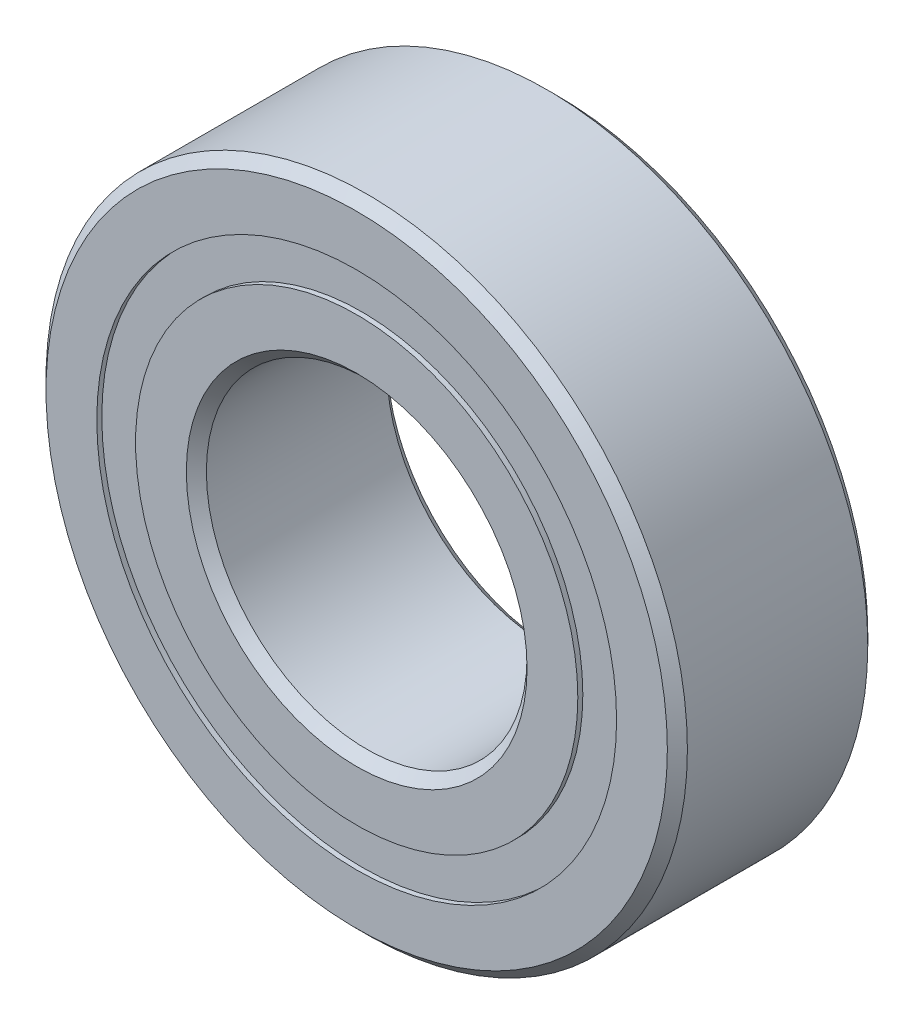
ISO-10303-21;
HEADER;
FILE_DESCRIPTION(('STEP AP214'),'2;1');
FILE_NAME('part.step','',(''),(''),'','','');
FILE_SCHEMA(('AUTOMOTIVE_DESIGN { 1 0 10303 214 1 1 1 1 }'));
ENDSEC;
DATA;
#1=APPLICATION_CONTEXT('core data for automotive mechanical design processes');
#2=APPLICATION_PROTOCOL_DEFINITION('international standard','automotive_design',2000,#1);
#3=PRODUCT_CONTEXT('',#1,'mechanical');
#4=PRODUCT('Part','Part','',(#3));
#5=PRODUCT_RELATED_PRODUCT_CATEGORY('part','',(#4));
#6=PRODUCT_DEFINITION_FORMATION('','',#4);
#7=PRODUCT_DEFINITION_CONTEXT('part definition',#1,'design');
#8=PRODUCT_DEFINITION('design','',#6,#7);
#9=PRODUCT_DEFINITION_SHAPE('','',#8);
#10=(LENGTH_UNIT() NAMED_UNIT(*) SI_UNIT(.MILLI.,.METRE.));
#11=(NAMED_UNIT(*) PLANE_ANGLE_UNIT() SI_UNIT($,.RADIAN.));
#12=(NAMED_UNIT(*) SI_UNIT($,.STERADIAN.) SOLID_ANGLE_UNIT());
#13=UNCERTAINTY_MEASURE_WITH_UNIT(LENGTH_MEASURE(1.E-05),#10,'distance_accuracy_value','');
#14=(GEOMETRIC_REPRESENTATION_CONTEXT(3) GLOBAL_UNCERTAINTY_ASSIGNED_CONTEXT((#13)) GLOBAL_UNIT_ASSIGNED_CONTEXT((#10,
#11,#12)) REPRESENTATION_CONTEXT('',''));
#15=CARTESIAN_POINT('',(0.,0.,0.));
#16=DIRECTION('',(0.,0.,1.));
#17=DIRECTION('',(1.,0.,0.));
#18=AXIS2_PLACEMENT_3D('',#15,#16,#17);
#19=CARTESIAN_POINT('',(0.,6.48351648351649,-2.375));
#20=DIRECTION('',(0.,0.,1.));
#21=DIRECTION('',(1.,0.,0.));
#22=AXIS2_PLACEMENT_3D('',#19,#20,#21);
#23=PLANE('',#22);
#24=CARTESIAN_POINT('',(0.,0.,-2.375));
#25=DIRECTION('',(0.,0.,1.));
#26=DIRECTION('',(1.,0.,0.));
#27=AXIS2_PLACEMENT_3D('',#24,#25,#26);
#28=CIRCLE('',#27,6.48351648351649);
#29=CARTESIAN_POINT('',(6.48351648351649,0.,-2.375));
#30=VERTEX_POINT('',#29);
#31=EDGE_CURVE('E55',#30,#30,#28,.T.);
#32=ORIENTED_EDGE('',*,*,#31,.F.);
#33=EDGE_LOOP('',(#32));
#34=FACE_BOUND('',#33,.T.);
#35=CARTESIAN_POINT('',(0.,0.,-2.375));
#36=DIRECTION('',(0.,0.,1.));
#37=DIRECTION('',(1.,0.,0.));
#38=AXIS2_PLACEMENT_3D('',#35,#36,#37);
#39=CIRCLE('',#38,5.51648351648352);
#40=CARTESIAN_POINT('',(5.51648351648352,0.,-2.375));
#41=VERTEX_POINT('',#40);
#42=EDGE_CURVE('E11',#41,#41,#39,.T.);
#43=ORIENTED_EDGE('',*,*,#42,.T.);
#44=EDGE_LOOP('',(#43));
#45=FACE_BOUND('',#44,.T.);
#46=ADVANCED_FACE('F41',(#34,#45),#23,.F.);
#47=CARTESIAN_POINT('',(0.,0.,2.5));
#48=DIRECTION('',(0.,0.,1.));
#49=DIRECTION('',(1.,0.,0.));
#50=AXIS2_PLACEMENT_3D('',#47,#48,#49);
#51=CYLINDRICAL_SURFACE('',#50,5.51648351648352);
#52=ORIENTED_EDGE('',*,*,#42,.F.);
#53=EDGE_LOOP('',(#52));
#54=FACE_BOUND('',#53,.T.);
#55=CARTESIAN_POINT('',(0.,0.,-1.21175743903915));
#56=DIRECTION('',(0.,0.,1.));
#57=DIRECTION('',(1.,0.,0.));
#58=AXIS2_PLACEMENT_3D('',#55,#56,#57);
#59=CIRCLE('',#58,5.51648351648352);
#60=CARTESIAN_POINT('',(5.51648351648352,0.,-1.21175743903915));
#61=VERTEX_POINT('',#60);
#62=EDGE_CURVE('E47',#61,#61,#59,.T.);
#63=ORIENTED_EDGE('',*,*,#62,.T.);
#64=EDGE_LOOP('',(#63));
#65=FACE_BOUND('',#64,.T.);
#66=ADVANCED_FACE('F64',(#54,#65),#51,.F.);
#67=CARTESIAN_POINT('',(0.,6.48351648351648,-1.21175743903915));
#68=DIRECTION('',(0.,0.,-1.));
#69=DIRECTION('',(-1.,0.,0.));
#70=AXIS2_PLACEMENT_3D('',#67,#68,#69);
#71=PLANE('',#70);
#72=ORIENTED_EDGE('',*,*,#62,.F.);
#73=EDGE_LOOP('',(#72));
#74=FACE_BOUND('',#73,.T.);
#75=CARTESIAN_POINT('',(0.,0.,-1.21175743903915));
#76=DIRECTION('',(0.,0.,1.));
#77=DIRECTION('',(1.,0.,0.));
#78=AXIS2_PLACEMENT_3D('',#75,#76,#77);
#79=CIRCLE('',#78,6.48351648351648);
#80=CARTESIAN_POINT('',(6.48351648351648,0.,-1.21175743903915));
#81=VERTEX_POINT('',#80);
#82=EDGE_CURVE('E51',#81,#81,#79,.T.);
#83=ORIENTED_EDGE('',*,*,#82,.T.);
#84=EDGE_LOOP('',(#83));
#85=FACE_BOUND('',#84,.T.);
#86=ADVANCED_FACE('F68',(#74,#85),#71,.F.);
#87=CARTESIAN_POINT('',(0.,0.,2.5));
#88=DIRECTION('',(0.,0.,1.));
#89=DIRECTION('',(1.,0.,0.));
#90=AXIS2_PLACEMENT_3D('',#87,#88,#89);
#91=CYLINDRICAL_SURFACE('',#90,6.48351648351649);
#92=ORIENTED_EDGE('',*,*,#82,.F.);
#93=EDGE_LOOP('',(#92));
#94=FACE_BOUND('',#93,.T.);
#95=ORIENTED_EDGE('',*,*,#31,.T.);
#96=EDGE_LOOP('',(#95));
#97=FACE_BOUND('',#96,.T.);
#98=ADVANCED_FACE('F61',(#94,#97),#91,.T.);
#99=CLOSED_SHELL('',(#46,#66,#86,#98));
#100=MANIFOLD_SOLID_BREP('B2',#99);
#101=CARTESIAN_POINT('',(0.,6.48351648351648,2.375));
#102=DIRECTION('',(0.,0.,-1.));
#103=DIRECTION('',(-1.,0.,0.));
#104=AXIS2_PLACEMENT_3D('',#101,#102,#103);
#105=PLANE('',#104);
#106=CARTESIAN_POINT('',(0.,0.,2.375));
#107=DIRECTION('',(0.,0.,1.));
#108=DIRECTION('',(1.,0.,0.));
#109=AXIS2_PLACEMENT_3D('',#106,#107,#108);
#110=CIRCLE('',#109,5.51648351648352);
#111=CARTESIAN_POINT('',(5.51648351648352,0.,2.375));
#112=VERTEX_POINT('',#111);
#113=EDGE_CURVE('E40',#112,#112,#110,.T.);
#114=ORIENTED_EDGE('',*,*,#113,.F.);
#115=EDGE_LOOP('',(#114));
#116=FACE_BOUND('',#115,.T.);
#117=CARTESIAN_POINT('',(0.,0.,2.375));
#118=DIRECTION('',(0.,0.,1.));
#119=DIRECTION('',(1.,0.,0.));
#120=AXIS2_PLACEMENT_3D('',#117,#118,#119);
#121=CIRCLE('',#120,6.48351648351648);
#122=CARTESIAN_POINT('',(6.48351648351648,0.,2.375));
#123=VERTEX_POINT('',#122);
#124=EDGE_CURVE('E122',#123,#123,#121,.T.);
#125=ORIENTED_EDGE('',*,*,#124,.T.);
#126=EDGE_LOOP('',(#125));
#127=FACE_BOUND('',#126,.T.);
#128=ADVANCED_FACE('F108',(#116,#127),#105,.F.);
#129=CARTESIAN_POINT('',(0.,0.,2.5));
#130=DIRECTION('',(0.,0.,1.));
#131=DIRECTION('',(1.,0.,0.));
#132=AXIS2_PLACEMENT_3D('',#129,#130,#131);
#133=CYLINDRICAL_SURFACE('',#132,5.51648351648352);
#134=CARTESIAN_POINT('',(0.,0.,1.21175743903915));
#135=DIRECTION('',(0.,0.,1.));
#136=DIRECTION('',(1.,0.,0.));
#137=AXIS2_PLACEMENT_3D('',#134,#135,#136);
#138=CIRCLE('',#137,5.51648351648352);
#139=CARTESIAN_POINT('',(5.51648351648352,0.,1.21175743903915));
#140=VERTEX_POINT('',#139);
#141=EDGE_CURVE('E114',#140,#140,#138,.T.);
#142=ORIENTED_EDGE('',*,*,#141,.F.);
#143=EDGE_LOOP('',(#142));
#144=FACE_BOUND('',#143,.T.);
#145=ORIENTED_EDGE('',*,*,#113,.T.);
#146=EDGE_LOOP('',(#145));
#147=FACE_BOUND('',#146,.T.);
#148=ADVANCED_FACE('F137',(#144,#147),#133,.F.);
#149=CARTESIAN_POINT('',(0.,6.48351648351648,1.21175743903915));
#150=DIRECTION('',(0.,0.,1.));
#151=DIRECTION('',(1.,0.,0.));
#152=AXIS2_PLACEMENT_3D('',#149,#150,#151);
#153=PLANE('',#152);
#154=CARTESIAN_POINT('',(0.,0.,1.21175743903915));
#155=DIRECTION('',(0.,0.,1.));
#156=DIRECTION('',(1.,0.,0.));
#157=AXIS2_PLACEMENT_3D('',#154,#155,#156);
#158=CIRCLE('',#157,6.48351648351648);
#159=CARTESIAN_POINT('',(6.48351648351648,0.,1.21175743903915));
#160=VERTEX_POINT('',#159);
#161=EDGE_CURVE('E118',#160,#160,#158,.T.);
#162=ORIENTED_EDGE('',*,*,#161,.F.);
#163=EDGE_LOOP('',(#162));
#164=FACE_BOUND('',#163,.T.);
#165=ORIENTED_EDGE('',*,*,#141,.T.);
#166=EDGE_LOOP('',(#165));
#167=FACE_BOUND('',#166,.T.);
#168=ADVANCED_FACE('F132',(#164,#167),#153,.F.);
#169=CARTESIAN_POINT('',(0.,0.,2.5));
#170=DIRECTION('',(0.,0.,1.));
#171=DIRECTION('',(1.,0.,0.));
#172=AXIS2_PLACEMENT_3D('',#169,#170,#171);
#173=CYLINDRICAL_SURFACE('',#172,6.48351648351648);
#174=ORIENTED_EDGE('',*,*,#124,.F.);
#175=EDGE_LOOP('',(#174));
#176=FACE_BOUND('',#175,.T.);
#177=ORIENTED_EDGE('',*,*,#161,.T.);
#178=EDGE_LOOP('',(#177));
#179=FACE_BOUND('',#178,.T.);
#180=ADVANCED_FACE('F129',(#176,#179),#173,.T.);
#181=CLOSED_SHELL('',(#128,#148,#168,#180));
#182=MANIFOLD_SOLID_BREP('B6',#181);
#183=CARTESIAN_POINT('',(-2.99999999999993,5.19615242270667,0.));
#184=DIRECTION('',(0.,0.,1.));
#185=DIRECTION('',(-0.499999999999989,0.866025403784445,0.));
#186=AXIS2_PLACEMENT_3D('',#183,#184,#185);
#187=SPHERICAL_SURFACE('',#186,1.21175743903915);
#188=CARTESIAN_POINT('',(-2.99999999999993,5.19615242270667,1.21175743903915));
#189=VERTEX_POINT('',#188);
#190=VERTEX_LOOP('',#189);
#191=FACE_BOUND('',#190,.T.);
#192=ADVANCED_FACE('F175',(#191),#187,.T.);
#193=CLOSED_SHELL('',(#192));
#194=MANIFOLD_SOLID_BREP('B35',#193);
#195=CARTESIAN_POINT('',(-5.1961524227066,3.00000000000006,0.));
#196=DIRECTION('',(0.,0.,1.));
#197=DIRECTION('',(-0.866025403784433,0.50000000000001,0.));
#198=AXIS2_PLACEMENT_3D('',#195,#196,#197);
#199=SPHERICAL_SURFACE('',#198,1.21175743903915);
#200=CARTESIAN_POINT('',(-5.1961524227066,3.00000000000006,1.21175743903915));
#201=VERTEX_POINT('',#200);
#202=VERTEX_LOOP('',#201);
#203=FACE_BOUND('',#202,.T.);
#204=ADVANCED_FACE('F195',(#203),#199,.T.);
#205=CLOSED_SHELL('',(#204));
#206=MANIFOLD_SOLID_BREP('B104',#205);
#207=CARTESIAN_POINT('',(-6.,0.,0.));
#208=DIRECTION('',(0.,0.,1.));
#209=DIRECTION('',(-1.,0.,0.));
#210=AXIS2_PLACEMENT_3D('',#207,#208,#209);
#211=SPHERICAL_SURFACE('',#210,1.21175743903915);
#212=CARTESIAN_POINT('',(-6.,0.,1.21175743903915));
#213=VERTEX_POINT('',#212);
#214=VERTEX_LOOP('',#213);
#215=FACE_BOUND('',#214,.T.);
#216=ADVANCED_FACE('F215',(#215),#211,.T.);
#217=CLOSED_SHELL('',(#216));
#218=MANIFOLD_SOLID_BREP('B171',#217);
#219=CARTESIAN_POINT('',(-5.19615242270666,-2.99999999999995,0.));
#220=DIRECTION('',(0.,0.,1.));
#221=DIRECTION('',(-0.866025403784443,-0.499999999999992,0.));
#222=AXIS2_PLACEMENT_3D('',#219,#220,#221);
#223=SPHERICAL_SURFACE('',#222,1.21175743903915);
#224=CARTESIAN_POINT('',(-5.19615242270666,-2.99999999999995,1.21175743903915));
#225=VERTEX_POINT('',#224);
#226=VERTEX_LOOP('',#225);
#227=FACE_BOUND('',#226,.T.);
#228=ADVANCED_FACE('F235',(#227),#223,.T.);
#229=CLOSED_SHELL('',(#228));
#230=MANIFOLD_SOLID_BREP('B191',#229);
#231=CARTESIAN_POINT('',(-3.00000000000004,-5.19615242270661,0.));
#232=DIRECTION('',(0.,0.,1.));
#233=DIRECTION('',(-0.500000000000007,-0.866025403784435,0.));
#234=AXIS2_PLACEMENT_3D('',#231,#232,#233);
#235=SPHERICAL_SURFACE('',#234,1.21175743903915);
#236=CARTESIAN_POINT('',(-3.00000000000004,-5.19615242270661,1.21175743903915));
#237=VERTEX_POINT('',#236);
#238=VERTEX_LOOP('',#237);
#239=FACE_BOUND('',#238,.T.);
#240=ADVANCED_FACE('F255',(#239),#235,.T.);
#241=CLOSED_SHELL('',(#240));
#242=MANIFOLD_SOLID_BREP('B211',#241);
#243=CARTESIAN_POINT('',(0.,-6.,0.));
#244=DIRECTION('',(0.,0.,1.));
#245=DIRECTION('',(0.,-1.,0.));
#246=AXIS2_PLACEMENT_3D('',#243,#244,#245);
#247=SPHERICAL_SURFACE('',#246,1.21175743903915);
#248=CARTESIAN_POINT('',(0.,-6.,1.21175743903915));
#249=VERTEX_POINT('',#248);
#250=VERTEX_LOOP('',#249);
#251=FACE_BOUND('',#250,.T.);
#252=ADVANCED_FACE('F275',(#251),#247,.T.);
#253=CLOSED_SHELL('',(#252));
#254=MANIFOLD_SOLID_BREP('B231',#253);
#255=CARTESIAN_POINT('',(2.99999999999997,-5.19615242270665,0.));
#256=DIRECTION('',(0.,0.,1.));
#257=DIRECTION('',(0.499999999999995,-0.866025403784442,0.));
#258=AXIS2_PLACEMENT_3D('',#255,#256,#257);
#259=SPHERICAL_SURFACE('',#258,1.21175743903915);
#260=CARTESIAN_POINT('',(2.99999999999997,-5.19615242270665,1.21175743903915));
#261=VERTEX_POINT('',#260);
#262=VERTEX_LOOP('',#261);
#263=FACE_BOUND('',#262,.T.);
#264=ADVANCED_FACE('F295',(#263),#259,.T.);
#265=CLOSED_SHELL('',(#264));
#266=MANIFOLD_SOLID_BREP('B251',#265);
#267=CARTESIAN_POINT('',(5.19615242270662,-3.00000000000002,0.));
#268=DIRECTION('',(0.,0.,1.));
#269=DIRECTION('',(0.866025403784436,-0.500000000000004,0.));
#270=AXIS2_PLACEMENT_3D('',#267,#268,#269);
#271=SPHERICAL_SURFACE('',#270,1.21175743903915);
#272=CARTESIAN_POINT('',(5.19615242270662,-3.00000000000002,1.21175743903915));
#273=VERTEX_POINT('',#272);
#274=VERTEX_LOOP('',#273);
#275=FACE_BOUND('',#274,.T.);
#276=ADVANCED_FACE('F315',(#275),#271,.T.);
#277=CLOSED_SHELL('',(#276));
#278=MANIFOLD_SOLID_BREP('B271',#277);
#279=CARTESIAN_POINT('',(6.,0.,0.));
#280=DIRECTION('',(0.,0.,1.));
#281=DIRECTION('',(1.,0.,0.));
#282=AXIS2_PLACEMENT_3D('',#279,#280,#281);
#283=SPHERICAL_SURFACE('',#282,1.21175743903915);
#284=CARTESIAN_POINT('',(6.,0.,1.21175743903915));
#285=VERTEX_POINT('',#284);
#286=VERTEX_LOOP('',#285);
#287=FACE_BOUND('',#286,.T.);
#288=ADVANCED_FACE('F335',(#287),#283,.T.);
#289=CLOSED_SHELL('',(#288));
#290=MANIFOLD_SOLID_BREP('B291',#289);
#291=CARTESIAN_POINT('',(5.19615242270664,2.99999999999999,0.));
#292=DIRECTION('',(0.,0.,1.));
#293=DIRECTION('',(0.86602540378444,0.499999999999998,0.));
#294=AXIS2_PLACEMENT_3D('',#291,#292,#293);
#295=SPHERICAL_SURFACE('',#294,1.21175743903915);
#296=CARTESIAN_POINT('',(5.19615242270664,2.99999999999999,1.21175743903915));
#297=VERTEX_POINT('',#296);
#298=VERTEX_LOOP('',#297);
#299=FACE_BOUND('',#298,.T.);
#300=ADVANCED_FACE('F355',(#299),#295,.T.);
#301=CLOSED_SHELL('',(#300));
#302=MANIFOLD_SOLID_BREP('B311',#301);
#303=CARTESIAN_POINT('',(3.00000000000001,5.19615242270663,0.));
#304=DIRECTION('',(0.,0.,1.));
#305=DIRECTION('',(0.500000000000001,0.866025403784438,0.));
#306=AXIS2_PLACEMENT_3D('',#303,#304,#305);
#307=SPHERICAL_SURFACE('',#306,1.21175743903915);
#308=CARTESIAN_POINT('',(3.00000000000001,5.19615242270663,1.21175743903915));
#309=VERTEX_POINT('',#308);
#310=VERTEX_LOOP('',#309);
#311=FACE_BOUND('',#310,.T.);
#312=ADVANCED_FACE('F375',(#311),#307,.T.);
#313=CLOSED_SHELL('',(#312));
#314=MANIFOLD_SOLID_BREP('B331',#313);
#315=CARTESIAN_POINT('',(0.,6.,0.));
#316=DIRECTION('',(0.,0.,1.));
#317=DIRECTION('',(0.,1.,0.));
#318=AXIS2_PLACEMENT_3D('',#315,#316,#317);
#319=SPHERICAL_SURFACE('',#318,1.21175743903915);
#320=CARTESIAN_POINT('',(0.,6.,1.21175743903915));
#321=VERTEX_POINT('',#320);
#322=VERTEX_LOOP('',#321);
#323=FACE_BOUND('',#322,.T.);
#324=ADVANCED_FACE('F397',(#323),#319,.T.);
#325=CLOSED_SHELL('',(#324));
#326=MANIFOLD_SOLID_BREP('B351',#325);
#327=CARTESIAN_POINT('',(0.,5.51648351648352,2.5));
#328=DIRECTION('',(0.,0.,-1.));
#329=DIRECTION('',(-1.,0.,0.));
#330=AXIS2_PLACEMENT_3D('',#327,#328,#329);
#331=PLANE('',#330);
#332=CARTESIAN_POINT('',(0.,0.,2.5));
#333=DIRECTION('',(0.,0.,1.));
#334=DIRECTION('',(1.,0.,0.));
#335=AXIS2_PLACEMENT_3D('',#332,#333,#334);
#336=CIRCLE('',#335,4.25);
#337=CARTESIAN_POINT('',(4.25,0.,2.5));
#338=VERTEX_POINT('',#337);
#339=EDGE_CURVE('E444',#338,#338,#336,.T.);
#340=ORIENTED_EDGE('',*,*,#339,.F.);
#341=EDGE_LOOP('',(#340));
#342=FACE_BOUND('',#341,.T.);
#343=CARTESIAN_POINT('',(0.,0.,2.5));
#344=DIRECTION('',(0.,0.,1.));
#345=DIRECTION('',(1.,0.,0.));
#346=AXIS2_PLACEMENT_3D('',#343,#344,#345);
#347=CIRCLE('',#346,5.51648351648352);
#348=CARTESIAN_POINT('',(5.51648351648352,0.,2.5));
#349=VERTEX_POINT('',#348);
#350=EDGE_CURVE('E396',#349,#349,#347,.T.);
#351=ORIENTED_EDGE('',*,*,#350,.T.);
#352=EDGE_LOOP('',(#351));
#353=FACE_BOUND('',#352,.T.);
#354=ADVANCED_FACE('F416',(#342,#353),#331,.F.);
#355=CARTESIAN_POINT('',(0.,0.,2.5));
#356=DIRECTION('',(0.,0.,1.));
#357=DIRECTION('',(1.,0.,0.));
#358=AXIS2_PLACEMENT_3D('',#355,#356,#357);
#359=CYLINDRICAL_SURFACE('',#358,5.51648351648352);
#360=ORIENTED_EDGE('',*,*,#350,.F.);
#361=EDGE_LOOP('',(#360));
#362=FACE_BOUND('',#361,.T.);
#363=CARTESIAN_POINT('',(0.,0.,1.11111111111111));
#364=DIRECTION('',(0.,0.,1.));
#365=DIRECTION('',(1.,0.,0.));
#366=AXIS2_PLACEMENT_3D('',#363,#364,#365);
#367=CIRCLE('',#366,5.51648351648352);
#368=CARTESIAN_POINT('',(5.51648351648352,0.,1.11111111111111));
#369=VERTEX_POINT('',#368);
#370=EDGE_CURVE('E422',#369,#369,#367,.T.);
#371=ORIENTED_EDGE('',*,*,#370,.T.);
#372=EDGE_LOOP('',(#371));
#373=FACE_BOUND('',#372,.T.);
#374=ADVANCED_FACE('F451',(#362,#373),#359,.T.);
#375=CARTESIAN_POINT('',(0.,0.,0.));
#376=DIRECTION('',(0.,0.,1.));
#377=DIRECTION('',(1.,0.,0.));
#378=AXIS2_PLACEMENT_3D('',#375,#376,#377);
#379=TOROIDAL_SURFACE('',#378,6.,1.21175743903915);
#380=ORIENTED_EDGE('',*,*,#370,.F.);
#381=EDGE_LOOP('',(#380));
#382=FACE_BOUND('',#381,.T.);
#383=CARTESIAN_POINT('',(0.,0.,-1.11111111111111));
#384=DIRECTION('',(0.,0.,1.));
#385=DIRECTION('',(1.,0.,0.));
#386=AXIS2_PLACEMENT_3D('',#383,#384,#385);
#387=CIRCLE('',#386,5.51648351648352);
#388=CARTESIAN_POINT('',(5.51648351648352,0.,-1.11111111111111));
#389=VERTEX_POINT('',#388);
#390=EDGE_CURVE('E426',#389,#389,#387,.T.);
#391=ORIENTED_EDGE('',*,*,#390,.T.);
#392=EDGE_LOOP('',(#391));
#393=FACE_BOUND('',#392,.T.);
#394=ADVANCED_FACE('F455',(#382,#393),#379,.F.);
#395=CARTESIAN_POINT('',(0.,0.,2.5));
#396=DIRECTION('',(0.,0.,1.));
#397=DIRECTION('',(1.,0.,0.));
#398=AXIS2_PLACEMENT_3D('',#395,#396,#397);
#399=CYLINDRICAL_SURFACE('',#398,5.51648351648352);
#400=ORIENTED_EDGE('',*,*,#390,.F.);
#401=EDGE_LOOP('',(#400));
#402=FACE_BOUND('',#401,.T.);
#403=CARTESIAN_POINT('',(0.,0.,-2.5));
#404=DIRECTION('',(0.,0.,1.));
#405=DIRECTION('',(1.,0.,0.));
#406=AXIS2_PLACEMENT_3D('',#403,#404,#405);
#407=CIRCLE('',#406,5.51648351648352);
#408=CARTESIAN_POINT('',(5.51648351648352,0.,-2.5));
#409=VERTEX_POINT('',#408);
#410=EDGE_CURVE('E430',#409,#409,#407,.T.);
#411=ORIENTED_EDGE('',*,*,#410,.T.);
#412=EDGE_LOOP('',(#411));
#413=FACE_BOUND('',#412,.T.);
#414=ADVANCED_FACE('F460',(#402,#413),#399,.T.);
#415=CARTESIAN_POINT('',(0.,4.25,-2.5));
#416=DIRECTION('',(0.,0.,1.));
#417=DIRECTION('',(1.,0.,0.));
#418=AXIS2_PLACEMENT_3D('',#415,#416,#417);
#419=PLANE('',#418);
#420=ORIENTED_EDGE('',*,*,#410,.F.);
#421=EDGE_LOOP('',(#420));
#422=FACE_BOUND('',#421,.T.);
#423=CARTESIAN_POINT('',(0.,0.,-2.5));
#424=DIRECTION('',(0.,0.,1.));
#425=DIRECTION('',(1.,0.,0.));
#426=AXIS2_PLACEMENT_3D('',#423,#424,#425);
#427=CIRCLE('',#426,4.25);
#428=CARTESIAN_POINT('',(4.25,0.,-2.5));
#429=VERTEX_POINT('',#428);
#430=EDGE_CURVE('E435',#429,#429,#427,.T.);
#431=ORIENTED_EDGE('',*,*,#430,.T.);
#432=EDGE_LOOP('',(#431));
#433=FACE_BOUND('',#432,.T.);
#434=ADVANCED_FACE('F466',(#422,#433),#419,.F.);
#435=CARTESIAN_POINT('',(0.,0.,-2.25));
#436=DIRECTION('',(0.,0.,-1.));
#437=DIRECTION('',(-1.,0.,0.));
#438=AXIS2_PLACEMENT_3D('',#435,#436,#437);
#439=CONICAL_SURFACE('',#438,4.,0.785398163397443);
#440=ORIENTED_EDGE('',*,*,#430,.F.);
#441=EDGE_LOOP('',(#440));
#442=FACE_BOUND('',#441,.T.);
#443=CARTESIAN_POINT('',(0.,0.,-2.25));
#444=DIRECTION('',(0.,0.,1.));
#445=DIRECTION('',(1.,0.,0.));
#446=AXIS2_PLACEMENT_3D('',#443,#444,#445);
#447=CIRCLE('',#446,4.);
#448=CARTESIAN_POINT('',(4.,0.,-2.25));
#449=VERTEX_POINT('',#448);
#450=EDGE_CURVE('E438',#449,#449,#447,.T.);
#451=ORIENTED_EDGE('',*,*,#450,.T.);
#452=EDGE_LOOP('',(#451));
#453=FACE_BOUND('',#452,.T.);
#454=ADVANCED_FACE('F470',(#442,#453),#439,.F.);
#455=CARTESIAN_POINT('',(0.,0.,2.5));
#456=DIRECTION('',(0.,0.,1.));
#457=DIRECTION('',(1.,0.,0.));
#458=AXIS2_PLACEMENT_3D('',#455,#456,#457);
#459=CYLINDRICAL_SURFACE('',#458,4.);
#460=ORIENTED_EDGE('',*,*,#450,.F.);
#461=EDGE_LOOP('',(#460));
#462=FACE_BOUND('',#461,.T.);
#463=CARTESIAN_POINT('',(0.,0.,2.25));
#464=DIRECTION('',(0.,0.,1.));
#465=DIRECTION('',(1.,0.,0.));
#466=AXIS2_PLACEMENT_3D('',#463,#464,#465);
#467=CIRCLE('',#466,4.);
#468=CARTESIAN_POINT('',(4.,0.,2.25));
#469=VERTEX_POINT('',#468);
#470=EDGE_CURVE('E441',#469,#469,#467,.T.);
#471=ORIENTED_EDGE('',*,*,#470,.T.);
#472=EDGE_LOOP('',(#471));
#473=FACE_BOUND('',#472,.T.);
#474=ADVANCED_FACE('F474',(#462,#473),#459,.F.);
#475=CARTESIAN_POINT('',(0.,0.,2.5));
#476=DIRECTION('',(0.,0.,1.));
#477=DIRECTION('',(1.,0.,0.));
#478=AXIS2_PLACEMENT_3D('',#475,#476,#477);
#479=CONICAL_SURFACE('',#478,4.25,0.785398163397453);
#480=ORIENTED_EDGE('',*,*,#470,.F.);
#481=EDGE_LOOP('',(#480));
#482=FACE_BOUND('',#481,.T.);
#483=ORIENTED_EDGE('',*,*,#339,.T.);
#484=EDGE_LOOP('',(#483));
#485=FACE_BOUND('',#484,.T.);
#486=ADVANCED_FACE('F448',(#482,#485),#479,.F.);
#487=CLOSED_SHELL('',(#354,#374,#394,#414,#434,#454,#474,#486));
#488=MANIFOLD_SOLID_BREP('B371',#487);
#489=CARTESIAN_POINT('',(0.,0.,2.25));
#490=DIRECTION('',(0.,0.,-1.));
#491=DIRECTION('',(-1.,0.,0.));
#492=AXIS2_PLACEMENT_3D('',#489,#490,#491);
#493=CONICAL_SURFACE('',#492,8.,0.785398163397446);
#494=CARTESIAN_POINT('',(0.,0.,2.5));
#495=DIRECTION('',(0.,0.,1.));
#496=DIRECTION('',(1.,0.,0.));
#497=AXIS2_PLACEMENT_3D('',#494,#495,#496);
#498=CIRCLE('',#497,7.75);
#499=CARTESIAN_POINT('',(7.75,0.,2.5));
#500=VERTEX_POINT('',#499);
#501=EDGE_CURVE('E565',#500,#500,#498,.T.);
#502=ORIENTED_EDGE('',*,*,#501,.F.);
#503=EDGE_LOOP('',(#502));
#504=FACE_BOUND('',#503,.T.);
#505=CARTESIAN_POINT('',(0.,0.,2.25));
#506=DIRECTION('',(0.,0.,1.));
#507=DIRECTION('',(1.,0.,0.));
#508=AXIS2_PLACEMENT_3D('',#505,#506,#507);
#509=CIRCLE('',#508,8.);
#510=CARTESIAN_POINT('',(8.,0.,2.25));
#511=VERTEX_POINT('',#510);
#512=EDGE_CURVE('E415',#511,#511,#509,.T.);
#513=ORIENTED_EDGE('',*,*,#512,.T.);
#514=EDGE_LOOP('',(#513));
#515=FACE_BOUND('',#514,.T.);
#516=ADVANCED_FACE('F537',(#504,#515),#493,.T.);
#517=CARTESIAN_POINT('',(0.,0.,2.5));
#518=DIRECTION('',(0.,0.,1.));
#519=DIRECTION('',(1.,0.,0.));
#520=AXIS2_PLACEMENT_3D('',#517,#518,#519);
#521=CYLINDRICAL_SURFACE('',#520,8.);
#522=ORIENTED_EDGE('',*,*,#512,.F.);
#523=EDGE_LOOP('',(#522));
#524=FACE_BOUND('',#523,.T.);
#525=CARTESIAN_POINT('',(0.,0.,-2.25));
#526=DIRECTION('',(0.,0.,1.));
#527=DIRECTION('',(1.,0.,0.));
#528=AXIS2_PLACEMENT_3D('',#525,#526,#527);
#529=CIRCLE('',#528,8.);
#530=CARTESIAN_POINT('',(8.,0.,-2.25));
#531=VERTEX_POINT('',#530);
#532=EDGE_CURVE('E543',#531,#531,#529,.T.);
#533=ORIENTED_EDGE('',*,*,#532,.T.);
#534=EDGE_LOOP('',(#533));
#535=FACE_BOUND('',#534,.T.);
#536=ADVANCED_FACE('F572',(#524,#535),#521,.T.);
#537=CARTESIAN_POINT('',(0.,0.,-2.5));
#538=DIRECTION('',(0.,0.,1.));
#539=DIRECTION('',(1.,0.,0.));
#540=AXIS2_PLACEMENT_3D('',#537,#538,#539);
#541=CONICAL_SURFACE('',#540,7.75,0.785398163397443);
#542=ORIENTED_EDGE('',*,*,#532,.F.);
#543=EDGE_LOOP('',(#542));
#544=FACE_BOUND('',#543,.T.);
#545=CARTESIAN_POINT('',(0.,0.,-2.5));
#546=DIRECTION('',(0.,0.,1.));
#547=DIRECTION('',(1.,0.,0.));
#548=AXIS2_PLACEMENT_3D('',#545,#546,#547);
#549=CIRCLE('',#548,7.75);
#550=CARTESIAN_POINT('',(7.75,0.,-2.5));
#551=VERTEX_POINT('',#550);
#552=EDGE_CURVE('E547',#551,#551,#549,.T.);
#553=ORIENTED_EDGE('',*,*,#552,.T.);
#554=EDGE_LOOP('',(#553));
#555=FACE_BOUND('',#554,.T.);
#556=ADVANCED_FACE('F576',(#544,#555),#541,.T.);
#557=CARTESIAN_POINT('',(0.,7.75,-2.5));
#558=DIRECTION('',(0.,0.,1.));
#559=DIRECTION('',(1.,0.,0.));
#560=AXIS2_PLACEMENT_3D('',#557,#558,#559);
#561=PLANE('',#560);
#562=ORIENTED_EDGE('',*,*,#552,.F.);
#563=EDGE_LOOP('',(#562));
#564=FACE_BOUND('',#563,.T.);
#565=CARTESIAN_POINT('',(0.,0.,-2.5));
#566=DIRECTION('',(0.,0.,1.));
#567=DIRECTION('',(1.,0.,0.));
#568=AXIS2_PLACEMENT_3D('',#565,#566,#567);
#569=CIRCLE('',#568,6.48351648351648);
#570=CARTESIAN_POINT('',(6.48351648351648,0.,-2.5));
#571=VERTEX_POINT('',#570);
#572=EDGE_CURVE('E551',#571,#571,#569,.T.);
#573=ORIENTED_EDGE('',*,*,#572,.T.);
#574=EDGE_LOOP('',(#573));
#575=FACE_BOUND('',#574,.T.);
#576=ADVANCED_FACE('F581',(#564,#575),#561,.F.);
#577=CARTESIAN_POINT('',(0.,0.,2.5));
#578=DIRECTION('',(0.,0.,1.));
#579=DIRECTION('',(1.,0.,0.));
#580=AXIS2_PLACEMENT_3D('',#577,#578,#579);
#581=CYLINDRICAL_SURFACE('',#580,6.48351648351648);
#582=ORIENTED_EDGE('',*,*,#572,.F.);
#583=EDGE_LOOP('',(#582));
#584=FACE_BOUND('',#583,.T.);
#585=CARTESIAN_POINT('',(0.,0.,-1.11111111111111));
#586=DIRECTION('',(0.,0.,1.));
#587=DIRECTION('',(1.,0.,0.));
#588=AXIS2_PLACEMENT_3D('',#585,#586,#587);
#589=CIRCLE('',#588,6.48351648351648);
#590=CARTESIAN_POINT('',(6.48351648351648,0.,-1.11111111111111));
#591=VERTEX_POINT('',#590);
#592=EDGE_CURVE('E556',#591,#591,#589,.T.);
#593=ORIENTED_EDGE('',*,*,#592,.T.);
#594=EDGE_LOOP('',(#593));
#595=FACE_BOUND('',#594,.T.);
#596=ADVANCED_FACE('F587',(#584,#595),#581,.F.);
#597=CARTESIAN_POINT('',(0.,0.,0.));
#598=DIRECTION('',(0.,0.,1.));
#599=DIRECTION('',(1.,0.,0.));
#600=AXIS2_PLACEMENT_3D('',#597,#598,#599);
#601=TOROIDAL_SURFACE('',#600,6.,1.21175743903915);
#602=ORIENTED_EDGE('',*,*,#592,.F.);
#603=EDGE_LOOP('',(#602));
#604=FACE_BOUND('',#603,.T.);
#605=CARTESIAN_POINT('',(0.,0.,1.11111111111111));
#606=DIRECTION('',(0.,0.,1.));
#607=DIRECTION('',(1.,0.,0.));
#608=AXIS2_PLACEMENT_3D('',#605,#606,#607);
#609=CIRCLE('',#608,6.48351648351648);
#610=CARTESIAN_POINT('',(6.48351648351648,0.,1.11111111111111));
#611=VERTEX_POINT('',#610);
#612=EDGE_CURVE('E559',#611,#611,#609,.T.);
#613=ORIENTED_EDGE('',*,*,#612,.T.);
#614=EDGE_LOOP('',(#613));
#615=FACE_BOUND('',#614,.T.);
#616=ADVANCED_FACE('F591',(#604,#615),#601,.F.);
#617=CARTESIAN_POINT('',(0.,0.,2.5));
#618=DIRECTION('',(0.,0.,1.));
#619=DIRECTION('',(1.,0.,0.));
#620=AXIS2_PLACEMENT_3D('',#617,#618,#619);
#621=CYLINDRICAL_SURFACE('',#620,6.48351648351648);
#622=ORIENTED_EDGE('',*,*,#612,.F.);
#623=EDGE_LOOP('',(#622));
#624=FACE_BOUND('',#623,.T.);
#625=CARTESIAN_POINT('',(0.,0.,2.5));
#626=DIRECTION('',(0.,0.,1.));
#627=DIRECTION('',(1.,0.,0.));
#628=AXIS2_PLACEMENT_3D('',#625,#626,#627);
#629=CIRCLE('',#628,6.48351648351648);
#630=CARTESIAN_POINT('',(6.48351648351648,0.,2.5));
#631=VERTEX_POINT('',#630);
#632=EDGE_CURVE('E562',#631,#631,#629,.T.);
#633=ORIENTED_EDGE('',*,*,#632,.T.);
#634=EDGE_LOOP('',(#633));
#635=FACE_BOUND('',#634,.T.);
#636=ADVANCED_FACE('F595',(#624,#635),#621,.F.);
#637=CARTESIAN_POINT('',(0.,7.75,2.5));
#638=DIRECTION('',(0.,0.,-1.));
#639=DIRECTION('',(-1.,0.,0.));
#640=AXIS2_PLACEMENT_3D('',#637,#638,#639);
#641=PLANE('',#640);
#642=ORIENTED_EDGE('',*,*,#632,.F.);
#643=EDGE_LOOP('',(#642));
#644=FACE_BOUND('',#643,.T.);
#645=ORIENTED_EDGE('',*,*,#501,.T.);
#646=EDGE_LOOP('',(#645));
#647=FACE_BOUND('',#646,.T.);
#648=ADVANCED_FACE('F569',(#644,#647),#641,.F.);
#649=CLOSED_SHELL('',(#516,#536,#556,#576,#596,#616,#636,#648));
#650=MANIFOLD_SOLID_BREP('B391',#649);
#651=ADVANCED_BREP_SHAPE_REPRESENTATION('',(#18,#100,#182,#194,#206,#218,#230,#242,#254,#266,
#278,#290,#302,#314,#326,#488,#650),#14);
#652=SHAPE_DEFINITION_REPRESENTATION(#9,#651);
ENDSEC;
END-ISO-10303-21;
